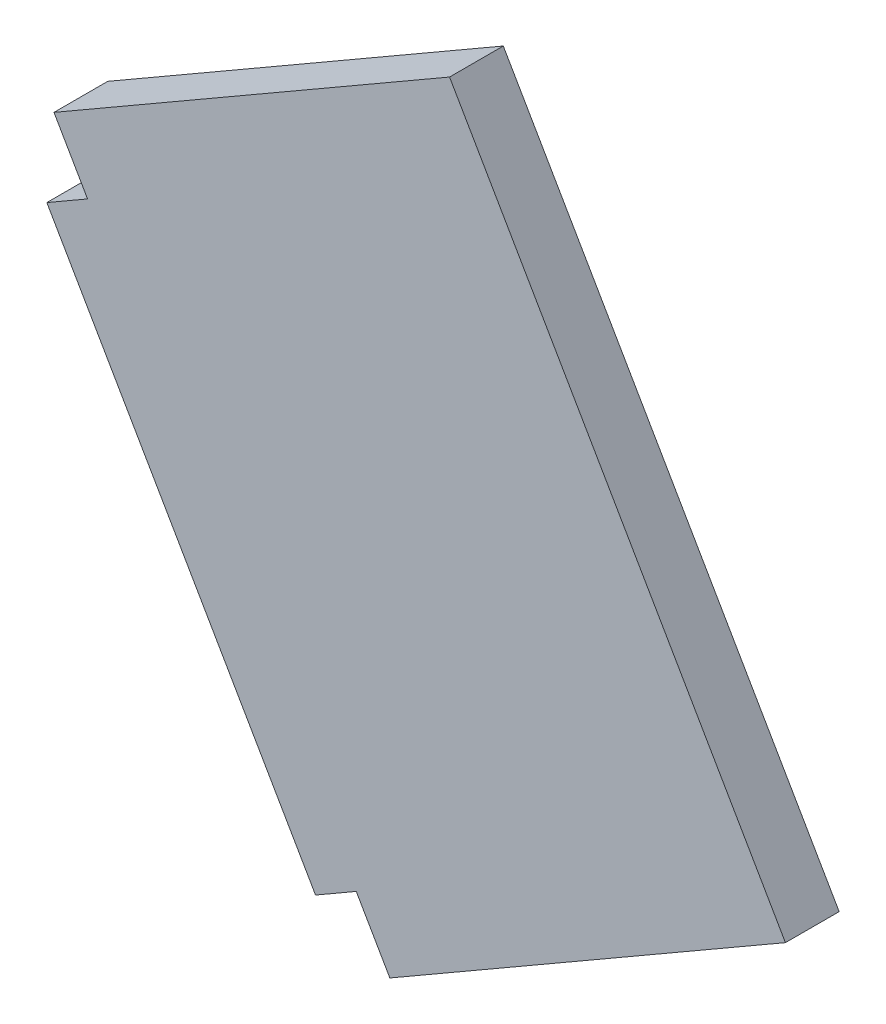
ISO-10303-21;
HEADER;
FILE_DESCRIPTION(('STEP AP214'),'2;1');
FILE_NAME('part.step','',(''),(''),'','','');
FILE_SCHEMA(('AUTOMOTIVE_DESIGN { 1 0 10303 214 1 1 1 1 }'));
ENDSEC;
DATA;
#1=APPLICATION_CONTEXT('core data for automotive mechanical design processes');
#2=APPLICATION_PROTOCOL_DEFINITION('international standard','automotive_design',2000,#1);
#3=PRODUCT_CONTEXT('',#1,'mechanical');
#4=PRODUCT('Part','Part','',(#3));
#5=PRODUCT_RELATED_PRODUCT_CATEGORY('part','',(#4));
#6=PRODUCT_DEFINITION_FORMATION('','',#4);
#7=PRODUCT_DEFINITION_CONTEXT('part definition',#1,'design');
#8=PRODUCT_DEFINITION('design','',#6,#7);
#9=PRODUCT_DEFINITION_SHAPE('','',#8);
#10=(LENGTH_UNIT() NAMED_UNIT(*) SI_UNIT(.MILLI.,.METRE.));
#11=(NAMED_UNIT(*) PLANE_ANGLE_UNIT() SI_UNIT($,.RADIAN.));
#12=(NAMED_UNIT(*) SI_UNIT($,.STERADIAN.) SOLID_ANGLE_UNIT());
#13=UNCERTAINTY_MEASURE_WITH_UNIT(LENGTH_MEASURE(1.E-05),#10,'distance_accuracy_value','');
#14=(GEOMETRIC_REPRESENTATION_CONTEXT(3) GLOBAL_UNCERTAINTY_ASSIGNED_CONTEXT((#13)) GLOBAL_UNIT_ASSIGNED_CONTEXT((#10,
#11,#12)) REPRESENTATION_CONTEXT('',''));
#15=CARTESIAN_POINT('',(0.,0.,0.));
#16=DIRECTION('',(0.,0.,1.));
#17=DIRECTION('',(1.,0.,0.));
#18=AXIS2_PLACEMENT_3D('',#15,#16,#17);
#19=CARTESIAN_POINT('',(1.42664718204935,1.40102540378444,0.));
#20=DIRECTION('',(-0.5,0.866025403784439,0.));
#21=DIRECTION('',(-0.866025403784439,-0.5,0.));
#22=AXIS2_PLACEMENT_3D('',#19,#20,#21);
#23=PLANE('',#22);
#24=DIRECTION('',(-0.866025403784439,-0.5,0.));
#25=VECTOR('',#24,1.);
#26=CARTESIAN_POINT('',(1.42664718204935,1.40102540378444,0.08));
#27=LINE('',#26,#25);
#28=CARTESIAN_POINT('',(2.01554445662277,1.74102540378444,0.08));
#29=VERTEX_POINT('',#28);
#30=CARTESIAN_POINT('',(1.42664718204935,1.40102540378444,0.08));
#31=VERTEX_POINT('',#30);
#32=EDGE_CURVE('E130',#29,#31,#27,.T.);
#33=ORIENTED_EDGE('',*,*,#32,.F.);
#34=DIRECTION('',(0.,0.,1.));
#35=VECTOR('',#34,1.);
#36=CARTESIAN_POINT('',(2.01554445662277,1.74102540378444,0.));
#37=LINE('',#36,#35);
#38=CARTESIAN_POINT('',(2.01554445662277,1.74102540378444,0.));
#39=VERTEX_POINT('',#38);
#40=EDGE_CURVE('E11',#39,#29,#37,.T.);
#41=ORIENTED_EDGE('',*,*,#40,.F.);
#42=DIRECTION('',(-0.866025403784439,-0.5,0.));
#43=VECTOR('',#42,1.);
#44=CARTESIAN_POINT('',(1.42664718204935,1.40102540378444,0.));
#45=LINE('',#44,#43);
#46=CARTESIAN_POINT('',(1.42664718204935,1.40102540378444,0.));
#47=VERTEX_POINT('',#46);
#48=EDGE_CURVE('E150',#39,#47,#45,.T.);
#49=ORIENTED_EDGE('',*,*,#48,.T.);
#50=DIRECTION('',(0.,0.,1.));
#51=VECTOR('',#50,1.);
#52=CARTESIAN_POINT('',(1.42664718204935,1.40102540378444,0.));
#53=LINE('',#52,#51);
#54=EDGE_CURVE('E36',#47,#31,#53,.T.);
#55=ORIENTED_EDGE('',*,*,#54,.T.);
#56=EDGE_LOOP('',(#33,#41,#49,#55));
#57=FACE_BOUND('',#56,.T.);
#58=ADVANCED_FACE('F33',(#57),#23,.T.);
#59=CARTESIAN_POINT('',(2.51554445662277,0.875000000000001,0.));
#60=DIRECTION('',(0.866025403784439,0.5,0.));
#61=DIRECTION('',(-0.5,0.866025403784439,0.));
#62=AXIS2_PLACEMENT_3D('',#59,#60,#61);
#63=PLANE('',#62);
#64=DIRECTION('',(-0.5,0.866025403784439,0.));
#65=VECTOR('',#64,1.);
#66=CARTESIAN_POINT('',(2.51554445662277,0.875000000000001,0.08));
#67=LINE('',#66,#65);
#68=CARTESIAN_POINT('',(2.51554445662277,0.875000000000001,0.08));
#69=VERTEX_POINT('',#68);
#70=EDGE_CURVE('E148',#69,#29,#67,.T.);
#71=ORIENTED_EDGE('',*,*,#70,.F.);
#72=DIRECTION('',(0.,0.,1.));
#73=VECTOR('',#72,1.);
#74=CARTESIAN_POINT('',(2.51554445662277,0.875000000000001,0.));
#75=LINE('',#74,#73);
#76=CARTESIAN_POINT('',(2.51554445662277,0.875000000000001,0.));
#77=VERTEX_POINT('',#76);
#78=EDGE_CURVE('E42',#77,#69,#75,.T.);
#79=ORIENTED_EDGE('',*,*,#78,.F.);
#80=DIRECTION('',(-0.5,0.866025403784439,0.));
#81=VECTOR('',#80,1.);
#82=CARTESIAN_POINT('',(2.51554445662277,0.875000000000001,0.));
#83=LINE('',#82,#81);
#84=EDGE_CURVE('E120',#77,#39,#83,.T.);
#85=ORIENTED_EDGE('',*,*,#84,.T.);
#86=ORIENTED_EDGE('',*,*,#40,.T.);
#87=EDGE_LOOP('',(#71,#79,#85,#86));
#88=FACE_BOUND('',#87,.T.);
#89=ADVANCED_FACE('F162',(#88),#63,.T.);
#90=CARTESIAN_POINT('',(1.92664718204935,0.535000000000001,0.));
#91=DIRECTION('',(0.5,-0.866025403784438,0.));
#92=DIRECTION('',(0.866025403784438,0.5,0.));
#93=AXIS2_PLACEMENT_3D('',#90,#91,#92);
#94=PLANE('',#93);
#95=DIRECTION('',(0.866025403784438,0.5,0.));
#96=VECTOR('',#95,1.);
#97=CARTESIAN_POINT('',(1.92664718204935,0.535000000000001,0.08));
#98=LINE('',#97,#96);
#99=CARTESIAN_POINT('',(1.92664718204935,0.535000000000001,0.08));
#100=VERTEX_POINT('',#99);
#101=EDGE_CURVE('E107',#100,#69,#98,.T.);
#102=ORIENTED_EDGE('',*,*,#101,.F.);
#103=DIRECTION('',(0.,0.,1.));
#104=VECTOR('',#103,1.);
#105=CARTESIAN_POINT('',(1.92664718204935,0.535000000000001,0.));
#106=LINE('',#105,#104);
#107=CARTESIAN_POINT('',(1.92664718204935,0.535000000000001,0.));
#108=VERTEX_POINT('',#107);
#109=EDGE_CURVE('E102',#108,#100,#106,.T.);
#110=ORIENTED_EDGE('',*,*,#109,.F.);
#111=DIRECTION('',(0.866025403784438,0.5,0.));
#112=VECTOR('',#111,1.);
#113=CARTESIAN_POINT('',(1.92664718204935,0.535000000000001,0.));
#114=LINE('',#113,#112);
#115=EDGE_CURVE('E105',#108,#77,#114,.T.);
#116=ORIENTED_EDGE('',*,*,#115,.T.);
#117=ORIENTED_EDGE('',*,*,#78,.T.);
#118=EDGE_LOOP('',(#102,#110,#116,#117));
#119=FACE_BOUND('',#118,.T.);
#120=ADVANCED_FACE('F104',(#119),#94,.T.);
#121=CARTESIAN_POINT('',(1.92664718204935,0.535000000000001,0.));
#122=DIRECTION('',(-0.866025403784437,-0.500000000000003,0.));
#123=DIRECTION('',(0.500000000000003,-0.866025403784437,0.));
#124=AXIS2_PLACEMENT_3D('',#121,#122,#123);
#125=PLANE('',#124);
#126=DIRECTION('',(0.500000000000002,-0.866025403784437,0.));
#127=VECTOR('',#126,1.);
#128=CARTESIAN_POINT('',(1.92664718204935,0.535000000000001,0.08));
#129=LINE('',#128,#127);
#130=CARTESIAN_POINT('',(1.87664718204935,0.621602540378444,0.08));
#131=VERTEX_POINT('',#130);
#132=EDGE_CURVE('E145',#131,#100,#129,.T.);
#133=ORIENTED_EDGE('',*,*,#132,.F.);
#134=DIRECTION('',(0.,0.,1.));
#135=VECTOR('',#134,1.);
#136=CARTESIAN_POINT('',(1.87664718204935,0.621602540378444,0.));
#137=LINE('',#136,#135);
#138=CARTESIAN_POINT('',(1.87664718204935,0.621602540378444,0.));
#139=VERTEX_POINT('',#138);
#140=EDGE_CURVE('E112',#139,#131,#137,.T.);
#141=ORIENTED_EDGE('',*,*,#140,.F.);
#142=DIRECTION('',(0.500000000000002,-0.866025403784437,0.));
#143=VECTOR('',#142,1.);
#144=CARTESIAN_POINT('',(1.92664718204935,0.535000000000001,0.));
#145=LINE('',#144,#143);
#146=EDGE_CURVE('E118',#139,#108,#145,.T.);
#147=ORIENTED_EDGE('',*,*,#146,.T.);
#148=ORIENTED_EDGE('',*,*,#109,.T.);
#149=EDGE_LOOP('',(#133,#141,#147,#148));
#150=FACE_BOUND('',#149,.T.);
#151=ADVANCED_FACE('F122',(#150),#125,.T.);
#152=CARTESIAN_POINT('',(1.87664718204935,0.621602540378444,0.));
#153=DIRECTION('',(0.500000000000001,-0.866025403784438,0.));
#154=DIRECTION('',(0.866025403784438,0.500000000000001,0.));
#155=AXIS2_PLACEMENT_3D('',#152,#153,#154);
#156=PLANE('',#155);
#157=DIRECTION('',(0.866025403784438,0.500000000000001,0.));
#158=VECTOR('',#157,1.);
#159=CARTESIAN_POINT('',(1.87664718204935,0.621602540378444,0.08));
#160=LINE('',#159,#158);
#161=CARTESIAN_POINT('',(1.81602540378444,0.586602540378444,0.08));
#162=VERTEX_POINT('',#161);
#163=EDGE_CURVE('E142',#162,#131,#160,.T.);
#164=ORIENTED_EDGE('',*,*,#163,.F.);
#165=DIRECTION('',(0.,0.,1.));
#166=VECTOR('',#165,1.);
#167=CARTESIAN_POINT('',(1.81602540378444,0.586602540378444,0.));
#168=LINE('',#167,#166);
#169=CARTESIAN_POINT('',(1.81602540378444,0.586602540378444,0.));
#170=VERTEX_POINT('',#169);
#171=EDGE_CURVE('E154',#170,#162,#168,.T.);
#172=ORIENTED_EDGE('',*,*,#171,.F.);
#173=DIRECTION('',(0.866025403784438,0.500000000000001,0.));
#174=VECTOR('',#173,1.);
#175=CARTESIAN_POINT('',(1.87664718204935,0.621602540378444,0.));
#176=LINE('',#175,#174);
#177=EDGE_CURVE('E123',#170,#139,#176,.T.);
#178=ORIENTED_EDGE('',*,*,#177,.T.);
#179=ORIENTED_EDGE('',*,*,#140,.T.);
#180=EDGE_LOOP('',(#164,#172,#178,#179));
#181=FACE_BOUND('',#180,.T.);
#182=ADVANCED_FACE('F175',(#181),#156,.T.);
#183=CARTESIAN_POINT('',(1.81602540378444,0.586602540378444,0.));
#184=DIRECTION('',(-0.866025403784439,-0.5,0.));
#185=DIRECTION('',(0.5,-0.866025403784439,0.));
#186=AXIS2_PLACEMENT_3D('',#183,#184,#185);
#187=PLANE('',#186);
#188=DIRECTION('',(0.5,-0.866025403784438,0.));
#189=VECTOR('',#188,1.);
#190=CARTESIAN_POINT('',(1.81602540378444,0.586602540378444,0.08));
#191=LINE('',#190,#189);
#192=CARTESIAN_POINT('',(1.41602540378444,1.279422863406,0.08));
#193=VERTEX_POINT('',#192);
#194=EDGE_CURVE('E139',#193,#162,#191,.T.);
#195=ORIENTED_EDGE('',*,*,#194,.F.);
#196=DIRECTION('',(0.,0.,1.));
#197=VECTOR('',#196,1.);
#198=CARTESIAN_POINT('',(1.41602540378444,1.279422863406,0.));
#199=LINE('',#198,#197);
#200=CARTESIAN_POINT('',(1.41602540378444,1.279422863406,0.));
#201=VERTEX_POINT('',#200);
#202=EDGE_CURVE('E156',#201,#193,#199,.T.);
#203=ORIENTED_EDGE('',*,*,#202,.F.);
#204=DIRECTION('',(0.5,-0.866025403784438,0.));
#205=VECTOR('',#204,1.);
#206=CARTESIAN_POINT('',(1.81602540378444,0.586602540378444,0.));
#207=LINE('',#206,#205);
#208=EDGE_CURVE('E125',#201,#170,#207,.T.);
#209=ORIENTED_EDGE('',*,*,#208,.T.);
#210=ORIENTED_EDGE('',*,*,#171,.T.);
#211=EDGE_LOOP('',(#195,#203,#209,#210));
#212=FACE_BOUND('',#211,.T.);
#213=ADVANCED_FACE('F178',(#212),#187,.T.);
#214=CARTESIAN_POINT('',(1.47664718204935,1.31442286340599,0.));
#215=DIRECTION('',(-0.499999999999996,0.866025403784441,0.));
#216=DIRECTION('',(-0.866025403784441,-0.499999999999996,0.));
#217=AXIS2_PLACEMENT_3D('',#214,#215,#216);
#218=PLANE('',#217);
#219=DIRECTION('',(-0.866025403784441,-0.499999999999996,0.));
#220=VECTOR('',#219,1.);
#221=CARTESIAN_POINT('',(1.47664718204935,1.31442286340599,0.08));
#222=LINE('',#221,#220);
#223=CARTESIAN_POINT('',(1.47664718204935,1.31442286340599,0.08));
#224=VERTEX_POINT('',#223);
#225=EDGE_CURVE('E136',#224,#193,#222,.T.);
#226=ORIENTED_EDGE('',*,*,#225,.F.);
#227=DIRECTION('',(0.,0.,1.));
#228=VECTOR('',#227,1.);
#229=CARTESIAN_POINT('',(1.47664718204935,1.31442286340599,0.));
#230=LINE('',#229,#228);
#231=CARTESIAN_POINT('',(1.47664718204935,1.31442286340599,0.));
#232=VERTEX_POINT('',#231);
#233=EDGE_CURVE('E157',#232,#224,#230,.T.);
#234=ORIENTED_EDGE('',*,*,#233,.F.);
#235=DIRECTION('',(-0.866025403784441,-0.499999999999996,0.));
#236=VECTOR('',#235,1.);
#237=CARTESIAN_POINT('',(1.47664718204935,1.31442286340599,0.));
#238=LINE('',#237,#236);
#239=EDGE_CURVE('E253',#232,#201,#238,.T.);
#240=ORIENTED_EDGE('',*,*,#239,.T.);
#241=ORIENTED_EDGE('',*,*,#202,.T.);
#242=EDGE_LOOP('',(#226,#234,#240,#241));
#243=FACE_BOUND('',#242,.T.);
#244=ADVANCED_FACE('F182',(#243),#218,.T.);
#245=CARTESIAN_POINT('',(1.42664718204935,1.40102540378444,0.));
#246=DIRECTION('',(-0.866025403784439,-0.499999999999999,0.));
#247=DIRECTION('',(0.499999999999999,-0.866025403784439,0.));
#248=AXIS2_PLACEMENT_3D('',#245,#246,#247);
#249=PLANE('',#248);
#250=DIRECTION('',(0.499999999999999,-0.866025403784439,0.));
#251=VECTOR('',#250,1.);
#252=CARTESIAN_POINT('',(1.42664718204935,1.40102540378444,0.08));
#253=LINE('',#252,#251);
#254=EDGE_CURVE('E133',#31,#224,#253,.T.);
#255=ORIENTED_EDGE('',*,*,#254,.F.);
#256=ORIENTED_EDGE('',*,*,#54,.F.);
#257=DIRECTION('',(0.499999999999999,-0.866025403784439,0.));
#258=VECTOR('',#257,1.);
#259=CARTESIAN_POINT('',(1.42664718204935,1.40102540378444,0.));
#260=LINE('',#259,#258);
#261=EDGE_CURVE('E254',#47,#232,#260,.T.);
#262=ORIENTED_EDGE('',*,*,#261,.T.);
#263=ORIENTED_EDGE('',*,*,#233,.T.);
#264=EDGE_LOOP('',(#255,#256,#262,#263));
#265=FACE_BOUND('',#264,.T.);
#266=ADVANCED_FACE('F159',(#265),#249,.T.);
#267=CARTESIAN_POINT('',(0.,0.,0.));
#268=DIRECTION('',(0.,0.,1.));
#269=DIRECTION('',(1.,0.,0.));
#270=AXIS2_PLACEMENT_3D('',#267,#268,#269);
#271=PLANE('',#270);
#272=ORIENTED_EDGE('',*,*,#48,.F.);
#273=ORIENTED_EDGE('',*,*,#84,.F.);
#274=ORIENTED_EDGE('',*,*,#115,.F.);
#275=ORIENTED_EDGE('',*,*,#146,.F.);
#276=ORIENTED_EDGE('',*,*,#177,.F.);
#277=ORIENTED_EDGE('',*,*,#208,.F.);
#278=ORIENTED_EDGE('',*,*,#239,.F.);
#279=ORIENTED_EDGE('',*,*,#261,.F.);
#280=EDGE_LOOP('',(#272,#273,#274,#275,#276,#277,#278,#279));
#281=FACE_BOUND('',#280,.T.);
#282=ADVANCED_FACE('F116',(#281),#271,.F.);
#283=CARTESIAN_POINT('',(0.,0.,0.08));
#284=DIRECTION('',(0.,0.,1.));
#285=DIRECTION('',(1.,0.,0.));
#286=AXIS2_PLACEMENT_3D('',#283,#284,#285);
#287=PLANE('',#286);
#288=ORIENTED_EDGE('',*,*,#32,.T.);
#289=ORIENTED_EDGE('',*,*,#254,.T.);
#290=ORIENTED_EDGE('',*,*,#225,.T.);
#291=ORIENTED_EDGE('',*,*,#194,.T.);
#292=ORIENTED_EDGE('',*,*,#163,.T.);
#293=ORIENTED_EDGE('',*,*,#132,.T.);
#294=ORIENTED_EDGE('',*,*,#101,.T.);
#295=ORIENTED_EDGE('',*,*,#70,.T.);
#296=EDGE_LOOP('',(#288,#289,#290,#291,#292,#293,#294,#295));
#297=FACE_BOUND('',#296,.T.);
#298=ADVANCED_FACE('F161',(#297),#287,.T.);
#299=CLOSED_SHELL('',(#58,#89,#120,#151,#182,#213,#244,#266,#282,#298));
#300=MANIFOLD_SOLID_BREP('B2',#299);
#301=ADVANCED_BREP_SHAPE_REPRESENTATION('',(#18,#300),#14);
#302=SHAPE_DEFINITION_REPRESENTATION(#9,#301);
ENDSEC;
END-ISO-10303-21;
